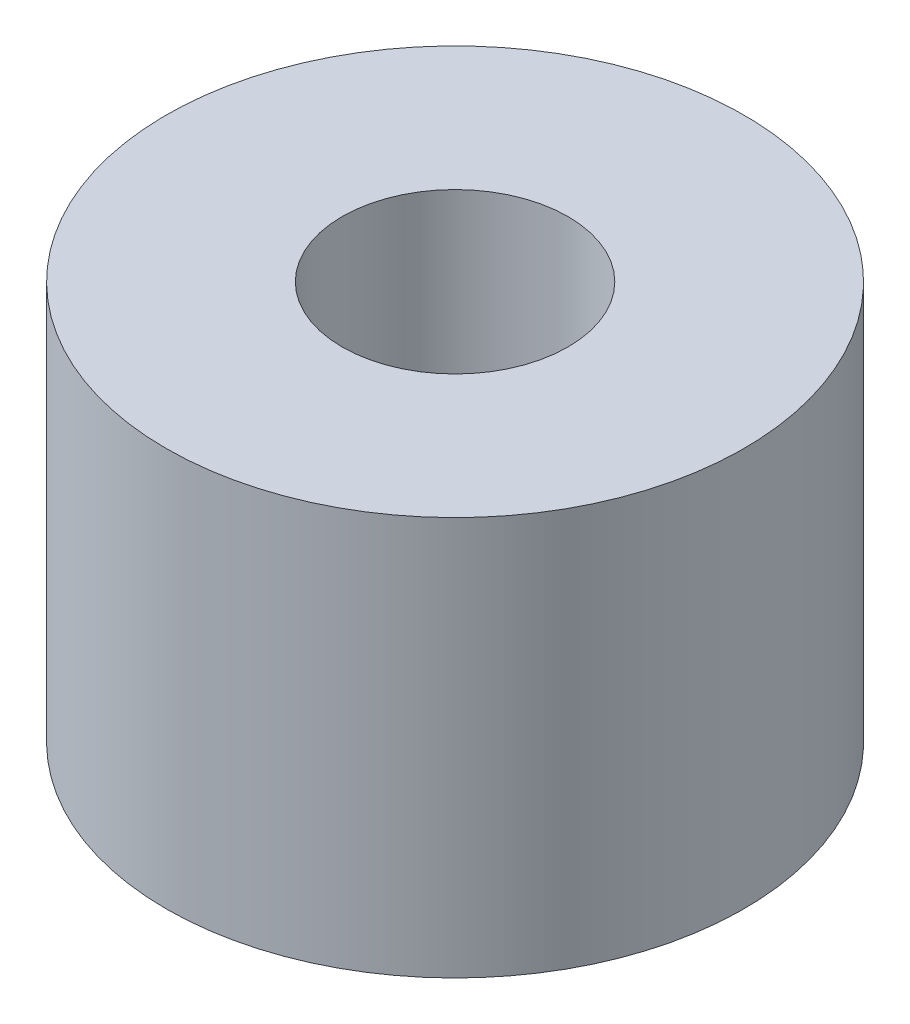
ISO-10303-21;
HEADER;
FILE_DESCRIPTION(('STEP AP214'),'2;1');
FILE_NAME('part.step','',(''),(''),'','','');
FILE_SCHEMA(('AUTOMOTIVE_DESIGN { 1 0 10303 214 1 1 1 1 }'));
ENDSEC;
DATA;
#1=APPLICATION_CONTEXT('core data for automotive mechanical design processes');
#2=APPLICATION_PROTOCOL_DEFINITION('international standard','automotive_design',2000,#1);
#3=PRODUCT_CONTEXT('',#1,'mechanical');
#4=PRODUCT('Part','Part','',(#3));
#5=PRODUCT_RELATED_PRODUCT_CATEGORY('part','',(#4));
#6=PRODUCT_DEFINITION_FORMATION('','',#4);
#7=PRODUCT_DEFINITION_CONTEXT('part definition',#1,'design');
#8=PRODUCT_DEFINITION('design','',#6,#7);
#9=PRODUCT_DEFINITION_SHAPE('','',#8);
#10=(LENGTH_UNIT() NAMED_UNIT(*) SI_UNIT(.MILLI.,.METRE.));
#11=(NAMED_UNIT(*) PLANE_ANGLE_UNIT() SI_UNIT($,.RADIAN.));
#12=(NAMED_UNIT(*) SI_UNIT($,.STERADIAN.) SOLID_ANGLE_UNIT());
#13=UNCERTAINTY_MEASURE_WITH_UNIT(LENGTH_MEASURE(1.E-05),#10,'distance_accuracy_value','');
#14=(GEOMETRIC_REPRESENTATION_CONTEXT(3) GLOBAL_UNCERTAINTY_ASSIGNED_CONTEXT((#13)) GLOBAL_UNIT_ASSIGNED_CONTEXT((#10,
#11,#12)) REPRESENTATION_CONTEXT('',''));
#15=CARTESIAN_POINT('',(0.,0.,0.));
#16=DIRECTION('',(0.,0.,1.));
#17=DIRECTION('',(1.,0.,0.));
#18=AXIS2_PLACEMENT_3D('',#15,#16,#17);
#19=CARTESIAN_POINT('',(0.,11.43,0.));
#20=DIRECTION('',(0.,1.,0.));
#21=DIRECTION('',(0.,0.,1.));
#22=AXIS2_PLACEMENT_3D('',#19,#20,#21);
#23=PLANE('',#22);
#24=CARTESIAN_POINT('',(0.,11.43,0.));
#25=DIRECTION('',(0.,1.,0.));
#26=DIRECTION('',(0.,0.,1.));
#27=AXIS2_PLACEMENT_3D('',#24,#25,#26);
#28=CIRCLE('',#27,8.2804);
#29=CARTESIAN_POINT('',(0.,11.43,8.2804));
#30=VERTEX_POINT('',#29);
#31=EDGE_CURVE('E10',#30,#30,#28,.T.);
#32=ORIENTED_EDGE('',*,*,#31,.T.);
#33=EDGE_LOOP('',(#32));
#34=FACE_BOUND('',#33,.T.);
#35=CARTESIAN_POINT('',(0.,11.43,0.));
#36=DIRECTION('',(0.,1.,0.));
#37=DIRECTION('',(0.,0.,1.));
#38=AXIS2_PLACEMENT_3D('',#35,#36,#37);
#39=CIRCLE('',#38,3.2385);
#40=CARTESIAN_POINT('',(0.,11.43,3.2385));
#41=VERTEX_POINT('',#40);
#42=EDGE_CURVE('E44',#41,#41,#39,.T.);
#43=ORIENTED_EDGE('',*,*,#42,.F.);
#44=EDGE_LOOP('',(#43));
#45=FACE_BOUND('',#44,.T.);
#46=ADVANCED_FACE('F33',(#34,#45),#23,.T.);
#47=CARTESIAN_POINT('',(0.,0.,0.));
#48=DIRECTION('',(0.,1.,0.));
#49=DIRECTION('',(0.,0.,1.));
#50=AXIS2_PLACEMENT_3D('',#47,#48,#49);
#51=PLANE('',#50);
#52=CARTESIAN_POINT('',(0.,0.,0.));
#53=DIRECTION('',(0.,1.,0.));
#54=DIRECTION('',(0.,0.,1.));
#55=AXIS2_PLACEMENT_3D('',#52,#53,#54);
#56=CIRCLE('',#55,8.2804);
#57=CARTESIAN_POINT('',(0.,0.,8.2804));
#58=VERTEX_POINT('',#57);
#59=EDGE_CURVE('E37',#58,#58,#56,.T.);
#60=ORIENTED_EDGE('',*,*,#59,.F.);
#61=EDGE_LOOP('',(#60));
#62=FACE_BOUND('',#61,.T.);
#63=CARTESIAN_POINT('',(0.,0.,0.));
#64=DIRECTION('',(0.,1.,0.));
#65=DIRECTION('',(0.,0.,1.));
#66=AXIS2_PLACEMENT_3D('',#63,#64,#65);
#67=CIRCLE('',#66,3.2385);
#68=CARTESIAN_POINT('',(0.,0.,3.2385));
#69=VERTEX_POINT('',#68);
#70=EDGE_CURVE('E46',#69,#69,#67,.T.);
#71=ORIENTED_EDGE('',*,*,#70,.T.);
#72=EDGE_LOOP('',(#71));
#73=FACE_BOUND('',#72,.T.);
#74=ADVANCED_FACE('F56',(#62,#73),#51,.F.);
#75=CARTESIAN_POINT('',(0.,11.43,0.));
#76=DIRECTION('',(0.,-1.,0.));
#77=DIRECTION('',(0.,0.,-1.));
#78=AXIS2_PLACEMENT_3D('',#75,#76,#77);
#79=CYLINDRICAL_SURFACE('',#78,8.2804);
#80=ORIENTED_EDGE('',*,*,#31,.F.);
#81=EDGE_LOOP('',(#80));
#82=FACE_BOUND('',#81,.T.);
#83=ORIENTED_EDGE('',*,*,#59,.T.);
#84=EDGE_LOOP('',(#83));
#85=FACE_BOUND('',#84,.T.);
#86=ADVANCED_FACE('F35',(#82,#85),#79,.T.);
#87=CARTESIAN_POINT('',(0.,11.43,0.));
#88=DIRECTION('',(0.,-1.,0.));
#89=DIRECTION('',(0.,0.,-1.));
#90=AXIS2_PLACEMENT_3D('',#87,#88,#89);
#91=CYLINDRICAL_SURFACE('',#90,3.2385);
#92=ORIENTED_EDGE('',*,*,#42,.T.);
#93=EDGE_LOOP('',(#92));
#94=FACE_BOUND('',#93,.T.);
#95=ORIENTED_EDGE('',*,*,#70,.F.);
#96=EDGE_LOOP('',(#95));
#97=FACE_BOUND('',#96,.T.);
#98=ADVANCED_FACE('F52',(#94,#97),#91,.F.);
#99=CLOSED_SHELL('',(#46,#74,#86,#98));
#100=MANIFOLD_SOLID_BREP('B2',#99);
#101=ADVANCED_BREP_SHAPE_REPRESENTATION('',(#18,#100),#14);
#102=SHAPE_DEFINITION_REPRESENTATION(#9,#101);
ENDSEC;
END-ISO-10303-21;
